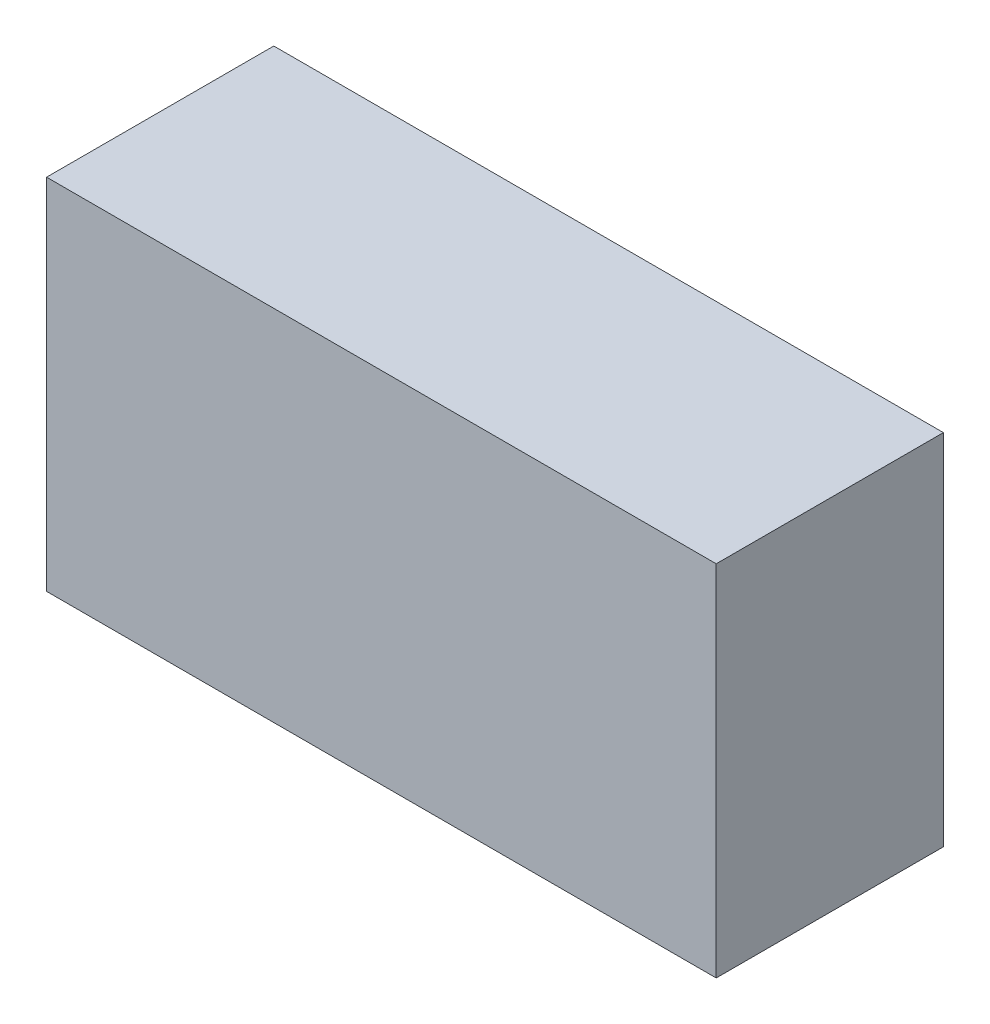
ISO-10303-21;
HEADER;
FILE_DESCRIPTION(('STEP AP214'),'2;1');
FILE_NAME('part.step','',(''),(''),'','','');
FILE_SCHEMA(('AUTOMOTIVE_DESIGN { 1 0 10303 214 1 1 1 1 }'));
ENDSEC;
DATA;
#1=APPLICATION_CONTEXT('core data for automotive mechanical design processes');
#2=APPLICATION_PROTOCOL_DEFINITION('international standard','automotive_design',2000,#1);
#3=PRODUCT_CONTEXT('',#1,'mechanical');
#4=PRODUCT('Part','Part','',(#3));
#5=PRODUCT_RELATED_PRODUCT_CATEGORY('part','',(#4));
#6=PRODUCT_DEFINITION_FORMATION('','',#4);
#7=PRODUCT_DEFINITION_CONTEXT('part definition',#1,'design');
#8=PRODUCT_DEFINITION('design','',#6,#7);
#9=PRODUCT_DEFINITION_SHAPE('','',#8);
#10=(LENGTH_UNIT() NAMED_UNIT(*) SI_UNIT(.MILLI.,.METRE.));
#11=(NAMED_UNIT(*) PLANE_ANGLE_UNIT() SI_UNIT($,.RADIAN.));
#12=(NAMED_UNIT(*) SI_UNIT($,.STERADIAN.) SOLID_ANGLE_UNIT());
#13=UNCERTAINTY_MEASURE_WITH_UNIT(LENGTH_MEASURE(1.E-05),#10,'distance_accuracy_value','');
#14=(GEOMETRIC_REPRESENTATION_CONTEXT(3) GLOBAL_UNCERTAINTY_ASSIGNED_CONTEXT((#13)) GLOBAL_UNIT_ASSIGNED_CONTEXT((#10,
#11,#12)) REPRESENTATION_CONTEXT('',''));
#15=CARTESIAN_POINT('',(0.,0.,0.));
#16=DIRECTION('',(0.,0.,1.));
#17=DIRECTION('',(1.,0.,0.));
#18=AXIS2_PLACEMENT_3D('',#15,#16,#17);
#19=CARTESIAN_POINT('',(7.97,2.8829,0.81916));
#20=DIRECTION('',(0.,0.,1.));
#21=DIRECTION('',(1.,0.,0.));
#22=AXIS2_PLACEMENT_3D('',#19,#20,#21);
#23=PLANE('',#22);
#24=DIRECTION('',(0.,1.,0.));
#25=VECTOR('',#24,1.);
#26=CARTESIAN_POINT('',(8.25,2.7329,0.81916));
#27=LINE('',#26,#25);
#28=CARTESIAN_POINT('',(8.25,3.0329,0.81916));
#29=VERTEX_POINT('',#28);
#30=CARTESIAN_POINT('',(8.25,2.7329,0.81916));
#31=VERTEX_POINT('',#30);
#32=EDGE_CURVE('E81',#29,#31,#27,.F.);
#33=ORIENTED_EDGE('',*,*,#32,.T.);
#34=DIRECTION('',(1.,0.,0.));
#35=VECTOR('',#34,1.);
#36=CARTESIAN_POINT('',(7.69,2.7329,0.81916));
#37=LINE('',#36,#35);
#38=CARTESIAN_POINT('',(7.69,2.7329,0.81916));
#39=VERTEX_POINT('',#38);
#40=EDGE_CURVE('E68',#31,#39,#37,.F.);
#41=ORIENTED_EDGE('',*,*,#40,.T.);
#42=DIRECTION('',(0.,1.,0.));
#43=VECTOR('',#42,1.);
#44=CARTESIAN_POINT('',(7.69,2.7329,0.81916));
#45=LINE('',#44,#43);
#46=CARTESIAN_POINT('',(7.69,3.0329,0.81916));
#47=VERTEX_POINT('',#46);
#48=EDGE_CURVE('E55',#39,#47,#45,.T.);
#49=ORIENTED_EDGE('',*,*,#48,.T.);
#50=DIRECTION('',(1.,0.,0.));
#51=VECTOR('',#50,1.);
#52=CARTESIAN_POINT('',(7.69,3.0329,0.81916));
#53=LINE('',#52,#51);
#54=EDGE_CURVE('E20',#47,#29,#53,.T.);
#55=ORIENTED_EDGE('',*,*,#54,.T.);
#56=EDGE_LOOP('',(#33,#41,#49,#55));
#57=FACE_BOUND('',#56,.T.);
#58=ADVANCED_FACE('F17',(#57),#23,.F.);
#59=CARTESIAN_POINT('',(7.69,3.0329,1.00916));
#60=DIRECTION('',(0.,-1.,0.));
#61=DIRECTION('',(0.,0.,-1.));
#62=AXIS2_PLACEMENT_3D('',#59,#60,#61);
#63=PLANE('',#62);
#64=DIRECTION('',(0.,0.,-1.));
#65=VECTOR('',#64,1.);
#66=CARTESIAN_POINT('',(7.69,3.0329,1.00916));
#67=LINE('',#66,#65);
#68=CARTESIAN_POINT('',(7.69,3.0329,1.00916));
#69=VERTEX_POINT('',#68);
#70=EDGE_CURVE('E61',#47,#69,#67,.F.);
#71=ORIENTED_EDGE('',*,*,#70,.T.);
#72=DIRECTION('',(1.,0.,0.));
#73=VECTOR('',#72,1.);
#74=CARTESIAN_POINT('',(7.97,3.0329,1.00916));
#75=LINE('',#74,#73);
#76=CARTESIAN_POINT('',(8.25,3.0329,1.00916));
#77=VERTEX_POINT('',#76);
#78=EDGE_CURVE('E83',#77,#69,#75,.F.);
#79=ORIENTED_EDGE('',*,*,#78,.F.);
#80=DIRECTION('',(0.,0.,1.));
#81=VECTOR('',#80,1.);
#82=CARTESIAN_POINT('',(8.25,3.0329,1.00916));
#83=LINE('',#82,#81);
#84=EDGE_CURVE('E64',#77,#29,#83,.F.);
#85=ORIENTED_EDGE('',*,*,#84,.T.);
#86=ORIENTED_EDGE('',*,*,#54,.F.);
#87=EDGE_LOOP('',(#71,#79,#85,#86));
#88=FACE_BOUND('',#87,.T.);
#89=ADVANCED_FACE('F60',(#88),#63,.F.);
#90=CARTESIAN_POINT('',(7.69,2.7329,1.00916));
#91=DIRECTION('',(1.,0.,0.));
#92=DIRECTION('',(0.,0.,-1.));
#93=AXIS2_PLACEMENT_3D('',#90,#91,#92);
#94=PLANE('',#93);
#95=DIRECTION('',(0.,0.,1.));
#96=VECTOR('',#95,1.);
#97=CARTESIAN_POINT('',(7.69,2.7329,1.00916));
#98=LINE('',#97,#96);
#99=CARTESIAN_POINT('',(7.69,2.7329,1.00916));
#100=VERTEX_POINT('',#99);
#101=EDGE_CURVE('E70',#39,#100,#98,.T.);
#102=ORIENTED_EDGE('',*,*,#101,.T.);
#103=DIRECTION('',(0.,1.,0.));
#104=VECTOR('',#103,1.);
#105=CARTESIAN_POINT('',(7.69,2.8829,1.00916));
#106=LINE('',#105,#104);
#107=EDGE_CURVE('E74',#69,#100,#106,.F.);
#108=ORIENTED_EDGE('',*,*,#107,.F.);
#109=ORIENTED_EDGE('',*,*,#70,.F.);
#110=ORIENTED_EDGE('',*,*,#48,.F.);
#111=EDGE_LOOP('',(#102,#108,#109,#110));
#112=FACE_BOUND('',#111,.T.);
#113=ADVANCED_FACE('F72',(#112),#94,.F.);
#114=CARTESIAN_POINT('',(7.69,2.7329,1.00916));
#115=DIRECTION('',(0.,1.,0.));
#116=DIRECTION('',(0.,0.,1.));
#117=AXIS2_PLACEMENT_3D('',#114,#115,#116);
#118=PLANE('',#117);
#119=DIRECTION('',(0.,0.,1.));
#120=VECTOR('',#119,1.);
#121=CARTESIAN_POINT('',(8.25,2.7329,1.00916));
#122=LINE('',#121,#120);
#123=CARTESIAN_POINT('',(8.25,2.7329,1.00916));
#124=VERTEX_POINT('',#123);
#125=EDGE_CURVE('E35',#31,#124,#122,.T.);
#126=ORIENTED_EDGE('',*,*,#125,.T.);
#127=DIRECTION('',(1.,0.,0.));
#128=VECTOR('',#127,1.);
#129=CARTESIAN_POINT('',(7.97,2.7329,1.00916));
#130=LINE('',#129,#128);
#131=EDGE_CURVE('E26',#100,#124,#130,.T.);
#132=ORIENTED_EDGE('',*,*,#131,.F.);
#133=ORIENTED_EDGE('',*,*,#101,.F.);
#134=ORIENTED_EDGE('',*,*,#40,.F.);
#135=EDGE_LOOP('',(#126,#132,#133,#134));
#136=FACE_BOUND('',#135,.T.);
#137=ADVANCED_FACE('F89',(#136),#118,.F.);
#138=CARTESIAN_POINT('',(8.25,2.7329,1.00916));
#139=DIRECTION('',(-1.,0.,0.));
#140=DIRECTION('',(0.,0.,1.));
#141=AXIS2_PLACEMENT_3D('',#138,#139,#140);
#142=PLANE('',#141);
#143=ORIENTED_EDGE('',*,*,#84,.F.);
#144=DIRECTION('',(0.,1.,0.));
#145=VECTOR('',#144,1.);
#146=CARTESIAN_POINT('',(8.25,2.8829,1.00916));
#147=LINE('',#146,#145);
#148=EDGE_CURVE('E11',#124,#77,#147,.T.);
#149=ORIENTED_EDGE('',*,*,#148,.F.);
#150=ORIENTED_EDGE('',*,*,#125,.F.);
#151=ORIENTED_EDGE('',*,*,#32,.F.);
#152=EDGE_LOOP('',(#143,#149,#150,#151));
#153=FACE_BOUND('',#152,.T.);
#154=ADVANCED_FACE('F91',(#153),#142,.F.);
#155=CARTESIAN_POINT('',(7.97,2.8829,1.00916));
#156=DIRECTION('',(0.,0.,1.));
#157=DIRECTION('',(1.,0.,0.));
#158=AXIS2_PLACEMENT_3D('',#155,#156,#157);
#159=PLANE('',#158);
#160=ORIENTED_EDGE('',*,*,#131,.T.);
#161=ORIENTED_EDGE('',*,*,#148,.T.);
#162=ORIENTED_EDGE('',*,*,#78,.T.);
#163=ORIENTED_EDGE('',*,*,#107,.T.);
#164=EDGE_LOOP('',(#160,#161,#162,#163));
#165=FACE_BOUND('',#164,.T.);
#166=ADVANCED_FACE('F88',(#165),#159,.T.);
#167=CLOSED_SHELL('',(#58,#89,#113,#137,#154,#166));
#168=MANIFOLD_SOLID_BREP('B1',#167);
#169=ADVANCED_BREP_SHAPE_REPRESENTATION('',(#18,#168),#14);
#170=SHAPE_DEFINITION_REPRESENTATION(#9,#169);
ENDSEC;
END-ISO-10303-21;
